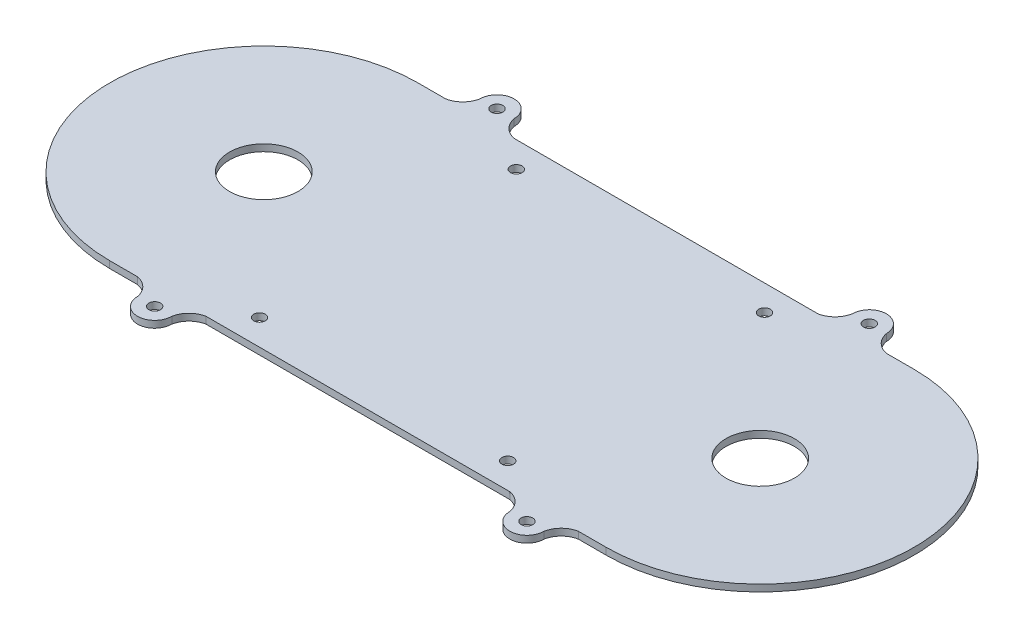
ISO-10303-21;
HEADER;
FILE_DESCRIPTION(('STEP AP214'),'2;1');
FILE_NAME('part.step','',(''),(''),'','','');
FILE_SCHEMA(('AUTOMOTIVE_DESIGN { 1 0 10303 214 1 1 1 1 }'));
ENDSEC;
DATA;
#1=APPLICATION_CONTEXT('core data for automotive mechanical design processes');
#2=APPLICATION_PROTOCOL_DEFINITION('international standard','automotive_design',2000,#1);
#3=PRODUCT_CONTEXT('',#1,'mechanical');
#4=PRODUCT('Part','Part','',(#3));
#5=PRODUCT_RELATED_PRODUCT_CATEGORY('part','',(#4));
#6=PRODUCT_DEFINITION_FORMATION('','',#4);
#7=PRODUCT_DEFINITION_CONTEXT('part definition',#1,'design');
#8=PRODUCT_DEFINITION('design','',#6,#7);
#9=PRODUCT_DEFINITION_SHAPE('','',#8);
#10=(LENGTH_UNIT() NAMED_UNIT(*) SI_UNIT(.MILLI.,.METRE.));
#11=(NAMED_UNIT(*) PLANE_ANGLE_UNIT() SI_UNIT($,.RADIAN.));
#12=(NAMED_UNIT(*) SI_UNIT($,.STERADIAN.) SOLID_ANGLE_UNIT());
#13=UNCERTAINTY_MEASURE_WITH_UNIT(LENGTH_MEASURE(1.E-05),#10,'distance_accuracy_value','');
#14=(GEOMETRIC_REPRESENTATION_CONTEXT(3) GLOBAL_UNCERTAINTY_ASSIGNED_CONTEXT((#13)) GLOBAL_UNIT_ASSIGNED_CONTEXT((#10,
#11,#12)) REPRESENTATION_CONTEXT('',''));
#15=CARTESIAN_POINT('',(0.,0.,0.));
#16=DIRECTION('',(0.,0.,1.));
#17=DIRECTION('',(1.,0.,0.));
#18=AXIS2_PLACEMENT_3D('',#15,#16,#17);
#19=CARTESIAN_POINT('',(0.,2.,0.));
#20=DIRECTION('',(0.,1.,0.));
#21=DIRECTION('',(0.,0.,1.));
#22=AXIS2_PLACEMENT_3D('',#19,#20,#21);
#23=PLANE('',#22);
#24=CARTESIAN_POINT('',(0.,2.,0.));
#25=DIRECTION('',(0.,1.,0.));
#26=DIRECTION('',(0.,0.,1.));
#27=AXIS2_PLACEMENT_3D('',#24,#25,#26);
#28=CIRCLE('',#27,10.);
#29=CARTESIAN_POINT('',(0.,2.,10.));
#30=VERTEX_POINT('',#29);
#31=EDGE_CURVE('E335',#30,#30,#28,.T.);
#32=ORIENTED_EDGE('',*,*,#31,.F.);
#33=EDGE_LOOP('',(#32));
#34=FACE_BOUND('',#33,.T.);
#35=CARTESIAN_POINT('',(145.,2.,0.));
#36=DIRECTION('',(0.,1.,0.));
#37=DIRECTION('',(0.,0.,1.));
#38=AXIS2_PLACEMENT_3D('',#35,#36,#37);
#39=CIRCLE('',#38,10.);
#40=CARTESIAN_POINT('',(145.,2.,10.));
#41=VERTEX_POINT('',#40);
#42=EDGE_CURVE('E496',#41,#41,#39,.T.);
#43=ORIENTED_EDGE('',*,*,#42,.F.);
#44=EDGE_LOOP('',(#43));
#45=FACE_BOUND('',#44,.T.);
#46=CARTESIAN_POINT('',(126.866817510313,2.,-49.9942003780549));
#47=DIRECTION('',(0.,1.,0.));
#48=DIRECTION('',(0.,0.,1.));
#49=AXIS2_PLACEMENT_3D('',#46,#47,#48);
#50=CIRCLE('',#49,1.70000000000001);
#51=CARTESIAN_POINT('',(126.866817510313,2.,-48.2942003780549));
#52=VERTEX_POINT('',#51);
#53=EDGE_CURVE('E341',#52,#52,#50,.F.);
#54=ORIENTED_EDGE('',*,*,#53,.T.);
#55=EDGE_LOOP('',(#54));
#56=FACE_BOUND('',#55,.T.);
#57=CARTESIAN_POINT('',(126.866817510313,2.,49.9942003780549));
#58=DIRECTION('',(0.,1.,0.));
#59=DIRECTION('',(0.,0.,1.));
#60=AXIS2_PLACEMENT_3D('',#57,#58,#59);
#61=CIRCLE('',#60,1.70000000000001);
#62=CARTESIAN_POINT('',(126.866817510313,2.,51.6942003780549));
#63=VERTEX_POINT('',#62);
#64=EDGE_CURVE('E346',#63,#63,#61,.T.);
#65=ORIENTED_EDGE('',*,*,#64,.F.);
#66=EDGE_LOOP('',(#65));
#67=FACE_BOUND('',#66,.T.);
#68=CARTESIAN_POINT('',(18.1168175103126,2.,49.9942003780549));
#69=DIRECTION('',(0.,1.,0.));
#70=DIRECTION('',(0.,0.,1.));
#71=AXIS2_PLACEMENT_3D('',#68,#69,#70);
#72=CIRCLE('',#71,1.7);
#73=CARTESIAN_POINT('',(18.1168175103126,2.,51.6942003780549));
#74=VERTEX_POINT('',#73);
#75=EDGE_CURVE('E324',#74,#74,#72,.T.);
#76=ORIENTED_EDGE('',*,*,#75,.F.);
#77=EDGE_LOOP('',(#76));
#78=FACE_BOUND('',#77,.T.);
#79=CARTESIAN_POINT('',(36.25,2.,-37.5000000000005));
#80=DIRECTION('',(0.,1.,0.));
#81=DIRECTION('',(0.,0.,1.));
#82=AXIS2_PLACEMENT_3D('',#79,#80,#81);
#83=CIRCLE('',#82,1.7);
#84=CARTESIAN_POINT('',(36.25,2.,-35.8000000000005));
#85=VERTEX_POINT('',#84);
#86=EDGE_CURVE('E281',#85,#85,#83,.F.);
#87=ORIENTED_EDGE('',*,*,#86,.T.);
#88=EDGE_LOOP('',(#87));
#89=FACE_BOUND('',#88,.T.);
#90=CARTESIAN_POINT('',(36.25,2.,37.5000000000005));
#91=DIRECTION('',(0.,1.,0.));
#92=DIRECTION('',(0.,0.,1.));
#93=AXIS2_PLACEMENT_3D('',#90,#91,#92);
#94=CIRCLE('',#93,1.7);
#95=CARTESIAN_POINT('',(36.25,2.,39.2000000000005));
#96=VERTEX_POINT('',#95);
#97=EDGE_CURVE('E354',#96,#96,#94,.T.);
#98=ORIENTED_EDGE('',*,*,#97,.F.);
#99=EDGE_LOOP('',(#98));
#100=FACE_BOUND('',#99,.T.);
#101=CARTESIAN_POINT('',(108.75,2.,37.5));
#102=DIRECTION('',(0.,1.,0.));
#103=DIRECTION('',(0.,0.,1.));
#104=AXIS2_PLACEMENT_3D('',#101,#102,#103);
#105=CIRCLE('',#104,1.7);
#106=CARTESIAN_POINT('',(108.75,2.,39.2));
#107=VERTEX_POINT('',#106);
#108=EDGE_CURVE('E357',#107,#107,#105,.T.);
#109=ORIENTED_EDGE('',*,*,#108,.F.);
#110=EDGE_LOOP('',(#109));
#111=FACE_BOUND('',#110,.T.);
#112=CARTESIAN_POINT('',(18.125,2.,-50.));
#113=DIRECTION('',(0.,1.,0.));
#114=DIRECTION('',(0.,0.,1.));
#115=AXIS2_PLACEMENT_3D('',#112,#113,#114);
#116=CIRCLE('',#115,5.);
#117=CARTESIAN_POINT('',(13.125,2.,-50.));
#118=VERTEX_POINT('',#117);
#119=CARTESIAN_POINT('',(23.125,2.,-50.));
#120=VERTEX_POINT('',#119);
#121=EDGE_CURVE('E360',#118,#120,#116,.F.);
#122=ORIENTED_EDGE('',*,*,#121,.F.);
#123=CARTESIAN_POINT('',(6.94058559663467,2.,-51.1844144033653));
#124=DIRECTION('',(0.,1.,0.));
#125=DIRECTION('',(0.,0.,1.));
#126=AXIS2_PLACEMENT_3D('',#123,#124,#125);
#127=CIRCLE('',#126,6.29681022355381);
#128=CARTESIAN_POINT('',(8.12499999999995,2.,-45.));
#129=VERTEX_POINT('',#128);
#130=EDGE_CURVE('E362',#118,#129,#127,.F.);
#131=ORIENTED_EDGE('',*,*,#130,.T.);
#132=DIRECTION('',(1.,0.,0.));
#133=VECTOR('',#132,1.);
#134=CARTESIAN_POINT('',(0.,2.,-45.));
#135=LINE('',#134,#133);
#136=CARTESIAN_POINT('',(0.,2.,-45.));
#137=VERTEX_POINT('',#136);
#138=EDGE_CURVE('E364',#137,#129,#135,.T.);
#139=ORIENTED_EDGE('',*,*,#138,.F.);
#140=CARTESIAN_POINT('',(0.,2.,0.));
#141=DIRECTION('',(0.,1.,0.));
#142=DIRECTION('',(0.,0.,1.));
#143=AXIS2_PLACEMENT_3D('',#140,#141,#142);
#144=CIRCLE('',#143,45.);
#145=CARTESIAN_POINT('',(0.,2.,45.));
#146=VERTEX_POINT('',#145);
#147=EDGE_CURVE('E367',#137,#146,#144,.T.);
#148=ORIENTED_EDGE('',*,*,#147,.T.);
#149=DIRECTION('',(1.,0.,0.));
#150=VECTOR('',#149,1.);
#151=CARTESIAN_POINT('',(0.,2.,45.));
#152=LINE('',#151,#150);
#153=CARTESIAN_POINT('',(8.12499999999995,2.,45.));
#154=VERTEX_POINT('',#153);
#155=EDGE_CURVE('E370',#146,#154,#152,.T.);
#156=ORIENTED_EDGE('',*,*,#155,.T.);
#157=CARTESIAN_POINT('',(6.94058559663467,2.,51.1844144033653));
#158=DIRECTION('',(0.,1.,0.));
#159=DIRECTION('',(0.,0.,1.));
#160=AXIS2_PLACEMENT_3D('',#157,#158,#159);
#161=CIRCLE('',#160,6.29681022355381);
#162=CARTESIAN_POINT('',(13.125,2.,50.));
#163=VERTEX_POINT('',#162);
#164=EDGE_CURVE('E372',#163,#154,#161,.T.);
#165=ORIENTED_EDGE('',*,*,#164,.F.);
#166=CARTESIAN_POINT('',(18.125,2.,50.));
#167=DIRECTION('',(0.,1.,0.));
#168=DIRECTION('',(0.,0.,1.));
#169=AXIS2_PLACEMENT_3D('',#166,#167,#168);
#170=CIRCLE('',#169,5.);
#171=CARTESIAN_POINT('',(23.125,2.,50.));
#172=VERTEX_POINT('',#171);
#173=EDGE_CURVE('E375',#163,#172,#170,.T.);
#174=ORIENTED_EDGE('',*,*,#173,.T.);
#175=CARTESIAN_POINT('',(29.3094144033653,2.,51.1844144033653));
#176=DIRECTION('',(0.,1.,0.));
#177=DIRECTION('',(0.,0.,1.));
#178=AXIS2_PLACEMENT_3D('',#175,#176,#177);
#179=CIRCLE('',#178,6.29681022355381);
#180=CARTESIAN_POINT('',(28.1250000000001,2.,45.));
#181=VERTEX_POINT('',#180);
#182=EDGE_CURVE('E378',#172,#181,#179,.F.);
#183=ORIENTED_EDGE('',*,*,#182,.T.);
#184=DIRECTION('',(1.,0.,0.));
#185=VECTOR('',#184,1.);
#186=CARTESIAN_POINT('',(0.,2.,45.));
#187=LINE('',#186,#185);
#188=CARTESIAN_POINT('',(116.875,2.,45.));
#189=VERTEX_POINT('',#188);
#190=EDGE_CURVE('E381',#181,#189,#187,.T.);
#191=ORIENTED_EDGE('',*,*,#190,.T.);
#192=CARTESIAN_POINT('',(115.690585596635,2.,51.1844144033653));
#193=DIRECTION('',(0.,1.,0.));
#194=DIRECTION('',(0.,0.,1.));
#195=AXIS2_PLACEMENT_3D('',#192,#193,#194);
#196=CIRCLE('',#195,6.29681022355381);
#197=CARTESIAN_POINT('',(121.875,2.,50.));
#198=VERTEX_POINT('',#197);
#199=EDGE_CURVE('E383',#198,#189,#196,.T.);
#200=ORIENTED_EDGE('',*,*,#199,.F.);
#201=CARTESIAN_POINT('',(126.875,2.,50.));
#202=DIRECTION('',(0.,1.,0.));
#203=DIRECTION('',(0.,0.,1.));
#204=AXIS2_PLACEMENT_3D('',#201,#202,#203);
#205=CIRCLE('',#204,5.);
#206=CARTESIAN_POINT('',(131.875,2.,50.));
#207=VERTEX_POINT('',#206);
#208=EDGE_CURVE('E386',#198,#207,#205,.T.);
#209=ORIENTED_EDGE('',*,*,#208,.T.);
#210=CARTESIAN_POINT('',(138.059414403365,2.,51.1844144033653));
#211=DIRECTION('',(0.,1.,0.));
#212=DIRECTION('',(0.,0.,1.));
#213=AXIS2_PLACEMENT_3D('',#210,#211,#212);
#214=CIRCLE('',#213,6.29681022355382);
#215=CARTESIAN_POINT('',(136.875,2.,45.));
#216=VERTEX_POINT('',#215);
#217=EDGE_CURVE('E389',#207,#216,#214,.F.);
#218=ORIENTED_EDGE('',*,*,#217,.T.);
#219=DIRECTION('',(-1.,0.,0.));
#220=VECTOR('',#219,1.);
#221=CARTESIAN_POINT('',(0.,2.,45.0000000000001));
#222=LINE('',#221,#220);
#223=CARTESIAN_POINT('',(145.,2.,45.));
#224=VERTEX_POINT('',#223);
#225=EDGE_CURVE('E391',#224,#216,#222,.T.);
#226=ORIENTED_EDGE('',*,*,#225,.F.);
#227=CARTESIAN_POINT('',(145.,2.,0.));
#228=DIRECTION('',(0.,1.,0.));
#229=DIRECTION('',(0.,0.,1.));
#230=AXIS2_PLACEMENT_3D('',#227,#228,#229);
#231=CIRCLE('',#230,45.);
#232=CARTESIAN_POINT('',(145.,2.,-45.));
#233=VERTEX_POINT('',#232);
#234=EDGE_CURVE('E394',#224,#233,#231,.T.);
#235=ORIENTED_EDGE('',*,*,#234,.T.);
#236=DIRECTION('',(1.,0.,0.));
#237=VECTOR('',#236,1.);
#238=CARTESIAN_POINT('',(0.,2.,-45.0000000000001));
#239=LINE('',#238,#237);
#240=CARTESIAN_POINT('',(136.875,2.,-45.));
#241=VERTEX_POINT('',#240);
#242=EDGE_CURVE('E396',#241,#233,#239,.T.);
#243=ORIENTED_EDGE('',*,*,#242,.F.);
#244=CARTESIAN_POINT('',(138.059414403365,2.,-51.1844144033653));
#245=DIRECTION('',(0.,1.,0.));
#246=DIRECTION('',(0.,0.,1.));
#247=AXIS2_PLACEMENT_3D('',#244,#245,#246);
#248=CIRCLE('',#247,6.29681022355382);
#249=CARTESIAN_POINT('',(131.875,2.,-50.));
#250=VERTEX_POINT('',#249);
#251=EDGE_CURVE('E399',#250,#241,#248,.T.);
#252=ORIENTED_EDGE('',*,*,#251,.F.);
#253=CARTESIAN_POINT('',(126.875,2.,-50.));
#254=DIRECTION('',(0.,1.,0.));
#255=DIRECTION('',(0.,0.,1.));
#256=AXIS2_PLACEMENT_3D('',#253,#254,#255);
#257=CIRCLE('',#256,5.);
#258=CARTESIAN_POINT('',(121.875,2.,-50.));
#259=VERTEX_POINT('',#258);
#260=EDGE_CURVE('E191',#259,#250,#257,.F.);
#261=ORIENTED_EDGE('',*,*,#260,.F.);
#262=CARTESIAN_POINT('',(115.690585596635,2.,-51.1844144033653));
#263=DIRECTION('',(0.,1.,0.));
#264=DIRECTION('',(0.,0.,1.));
#265=AXIS2_PLACEMENT_3D('',#262,#263,#264);
#266=CIRCLE('',#265,6.29681022355381);
#267=CARTESIAN_POINT('',(116.875,2.,-45.));
#268=VERTEX_POINT('',#267);
#269=EDGE_CURVE('E182',#259,#268,#266,.F.);
#270=ORIENTED_EDGE('',*,*,#269,.T.);
#271=DIRECTION('',(1.,0.,0.));
#272=VECTOR('',#271,1.);
#273=CARTESIAN_POINT('',(0.,2.,-45.));
#274=LINE('',#273,#272);
#275=CARTESIAN_POINT('',(28.1250000000001,2.,-45.));
#276=VERTEX_POINT('',#275);
#277=EDGE_CURVE('E188',#276,#268,#274,.T.);
#278=ORIENTED_EDGE('',*,*,#277,.F.);
#279=CARTESIAN_POINT('',(29.3094144033653,2.,-51.1844144033653));
#280=DIRECTION('',(0.,1.,0.));
#281=DIRECTION('',(0.,0.,1.));
#282=AXIS2_PLACEMENT_3D('',#279,#280,#281);
#283=CIRCLE('',#282,6.29681022355381);
#284=EDGE_CURVE('E204',#120,#276,#283,.T.);
#285=ORIENTED_EDGE('',*,*,#284,.F.);
#286=EDGE_LOOP('',(#122,#131,#139,#148,#156,#165,#174,#183,#191,#200,#209,#218,#226,#235,#243,
#252,#261,#270,#278,#285));
#287=FACE_BOUND('',#286,.T.);
#288=CARTESIAN_POINT('',(108.75,2.,-37.5));
#289=DIRECTION('',(0.,1.,0.));
#290=DIRECTION('',(0.,0.,1.));
#291=AXIS2_PLACEMENT_3D('',#288,#289,#290);
#292=CIRCLE('',#291,1.7);
#293=CARTESIAN_POINT('',(108.75,2.,-35.8));
#294=VERTEX_POINT('',#293);
#295=EDGE_CURVE('E206',#294,#294,#292,.F.);
#296=ORIENTED_EDGE('',*,*,#295,.T.);
#297=EDGE_LOOP('',(#296));
#298=FACE_BOUND('',#297,.T.);
#299=CARTESIAN_POINT('',(18.1168175103126,2.,-49.9942003780549));
#300=DIRECTION('',(0.,1.,0.));
#301=DIRECTION('',(0.,0.,1.));
#302=AXIS2_PLACEMENT_3D('',#299,#300,#301);
#303=CIRCLE('',#302,1.7);
#304=CARTESIAN_POINT('',(18.1168175103126,2.,-48.2942003780549));
#305=VERTEX_POINT('',#304);
#306=EDGE_CURVE('E337',#305,#305,#303,.F.);
#307=ORIENTED_EDGE('',*,*,#306,.T.);
#308=EDGE_LOOP('',(#307));
#309=FACE_BOUND('',#308,.T.);
#310=ADVANCED_FACE('F39',(#34,#45,#56,#67,#78,#89,#100,#111,#287,#298,#309),#23,.T.);
#311=CARTESIAN_POINT('',(0.,0.,0.));
#312=DIRECTION('',(0.,1.,0.));
#313=DIRECTION('',(0.,0.,1.));
#314=AXIS2_PLACEMENT_3D('',#311,#312,#313);
#315=PLANE('',#314);
#316=CARTESIAN_POINT('',(72.5,0.,0.));
#317=DIRECTION('',(0.,1.,0.));
#318=DIRECTION('',(0.,0.,1.));
#319=AXIS2_PLACEMENT_3D('',#316,#317,#318);
#320=CIRCLE('',#319,4.99999999999999);
#321=CARTESIAN_POINT('',(72.5,0.,5.));
#322=VERTEX_POINT('',#321);
#323=EDGE_CURVE('E11',#322,#322,#320,.F.);
#324=ORIENTED_EDGE('',*,*,#323,.F.);
#325=EDGE_LOOP('',(#324));
#326=FACE_BOUND('',#325,.T.);
#327=CARTESIAN_POINT('',(0.,0.,0.));
#328=DIRECTION('',(0.,1.,0.));
#329=DIRECTION('',(0.,0.,1.));
#330=AXIS2_PLACEMENT_3D('',#327,#328,#329);
#331=CIRCLE('',#330,10.);
#332=CARTESIAN_POINT('',(0.,0.,10.));
#333=VERTEX_POINT('',#332);
#334=EDGE_CURVE('E334',#333,#333,#331,.T.);
#335=ORIENTED_EDGE('',*,*,#334,.T.);
#336=EDGE_LOOP('',(#335));
#337=FACE_BOUND('',#336,.T.);
#338=CARTESIAN_POINT('',(145.,0.,0.));
#339=DIRECTION('',(0.,1.,0.));
#340=DIRECTION('',(0.,0.,1.));
#341=AXIS2_PLACEMENT_3D('',#338,#339,#340);
#342=CIRCLE('',#341,10.);
#343=CARTESIAN_POINT('',(145.,0.,10.));
#344=VERTEX_POINT('',#343);
#345=EDGE_CURVE('E332',#344,#344,#342,.T.);
#346=ORIENTED_EDGE('',*,*,#345,.T.);
#347=EDGE_LOOP('',(#346));
#348=FACE_BOUND('',#347,.T.);
#349=CARTESIAN_POINT('',(126.866817510313,0.,49.9942003780549));
#350=DIRECTION('',(0.,1.,0.));
#351=DIRECTION('',(0.,0.,1.));
#352=AXIS2_PLACEMENT_3D('',#349,#350,#351);
#353=CIRCLE('',#352,1.70000000000001);
#354=CARTESIAN_POINT('',(126.866817510313,0.,51.6942003780549));
#355=VERTEX_POINT('',#354);
#356=EDGE_CURVE('E323',#355,#355,#353,.T.);
#357=ORIENTED_EDGE('',*,*,#356,.T.);
#358=EDGE_LOOP('',(#357));
#359=FACE_BOUND('',#358,.T.);
#360=CARTESIAN_POINT('',(18.1168175103126,0.,49.9942003780549));
#361=DIRECTION('',(0.,1.,0.));
#362=DIRECTION('',(0.,0.,1.));
#363=AXIS2_PLACEMENT_3D('',#360,#361,#362);
#364=CIRCLE('',#363,1.7);
#365=CARTESIAN_POINT('',(18.1168175103126,0.,51.6942003780549));
#366=VERTEX_POINT('',#365);
#367=EDGE_CURVE('E320',#366,#366,#364,.T.);
#368=ORIENTED_EDGE('',*,*,#367,.T.);
#369=EDGE_LOOP('',(#368));
#370=FACE_BOUND('',#369,.T.);
#371=CARTESIAN_POINT('',(36.25,0.,-37.5000000000005));
#372=DIRECTION('',(0.,1.,0.));
#373=DIRECTION('',(0.,0.,1.));
#374=AXIS2_PLACEMENT_3D('',#371,#372,#373);
#375=CIRCLE('',#374,1.7);
#376=CARTESIAN_POINT('',(36.25,0.,-35.8000000000005));
#377=VERTEX_POINT('',#376);
#378=EDGE_CURVE('E212',#377,#377,#375,.F.);
#379=ORIENTED_EDGE('',*,*,#378,.F.);
#380=EDGE_LOOP('',(#379));
#381=FACE_BOUND('',#380,.T.);
#382=CARTESIAN_POINT('',(36.25,0.,37.5000000000005));
#383=DIRECTION('',(0.,1.,0.));
#384=DIRECTION('',(0.,0.,1.));
#385=AXIS2_PLACEMENT_3D('',#382,#383,#384);
#386=CIRCLE('',#385,1.7);
#387=CARTESIAN_POINT('',(36.25,0.,39.2000000000005));
#388=VERTEX_POINT('',#387);
#389=EDGE_CURVE('E215',#388,#388,#386,.T.);
#390=ORIENTED_EDGE('',*,*,#389,.T.);
#391=EDGE_LOOP('',(#390));
#392=FACE_BOUND('',#391,.T.);
#393=CARTESIAN_POINT('',(108.75,0.,37.5));
#394=DIRECTION('',(0.,1.,0.));
#395=DIRECTION('',(0.,0.,1.));
#396=AXIS2_PLACEMENT_3D('',#393,#394,#395);
#397=CIRCLE('',#396,1.7);
#398=CARTESIAN_POINT('',(108.75,0.,39.2));
#399=VERTEX_POINT('',#398);
#400=EDGE_CURVE('E219',#399,#399,#397,.T.);
#401=ORIENTED_EDGE('',*,*,#400,.T.);
#402=EDGE_LOOP('',(#401));
#403=FACE_BOUND('',#402,.T.);
#404=CARTESIAN_POINT('',(18.125,0.,-50.));
#405=DIRECTION('',(0.,1.,0.));
#406=DIRECTION('',(0.,0.,1.));
#407=AXIS2_PLACEMENT_3D('',#404,#405,#406);
#408=CIRCLE('',#407,5.);
#409=CARTESIAN_POINT('',(13.125,0.,-50.));
#410=VERTEX_POINT('',#409);
#411=CARTESIAN_POINT('',(23.125,0.,-50.));
#412=VERTEX_POINT('',#411);
#413=EDGE_CURVE('E222',#410,#412,#408,.F.);
#414=ORIENTED_EDGE('',*,*,#413,.T.);
#415=CARTESIAN_POINT('',(29.3094144033653,0.,-51.1844144033653));
#416=DIRECTION('',(0.,1.,0.));
#417=DIRECTION('',(0.,0.,1.));
#418=AXIS2_PLACEMENT_3D('',#415,#416,#417);
#419=CIRCLE('',#418,6.29681022355381);
#420=CARTESIAN_POINT('',(28.1250000000001,0.,-45.));
#421=VERTEX_POINT('',#420);
#422=EDGE_CURVE('E275',#412,#421,#419,.T.);
#423=ORIENTED_EDGE('',*,*,#422,.T.);
#424=DIRECTION('',(1.,0.,0.));
#425=VECTOR('',#424,1.);
#426=CARTESIAN_POINT('',(0.,0.,-45.));
#427=LINE('',#426,#425);
#428=CARTESIAN_POINT('',(116.875,0.,-45.));
#429=VERTEX_POINT('',#428);
#430=EDGE_CURVE('E273',#421,#429,#427,.T.);
#431=ORIENTED_EDGE('',*,*,#430,.T.);
#432=CARTESIAN_POINT('',(115.690585596635,0.,-51.1844144033653));
#433=DIRECTION('',(0.,1.,0.));
#434=DIRECTION('',(0.,0.,1.));
#435=AXIS2_PLACEMENT_3D('',#432,#433,#434);
#436=CIRCLE('',#435,6.29681022355381);
#437=CARTESIAN_POINT('',(121.875,0.,-50.));
#438=VERTEX_POINT('',#437);
#439=EDGE_CURVE('E198',#438,#429,#436,.F.);
#440=ORIENTED_EDGE('',*,*,#439,.F.);
#441=CARTESIAN_POINT('',(126.875,0.,-50.));
#442=DIRECTION('',(0.,1.,0.));
#443=DIRECTION('',(0.,0.,1.));
#444=AXIS2_PLACEMENT_3D('',#441,#442,#443);
#445=CIRCLE('',#444,5.);
#446=CARTESIAN_POINT('',(131.875,0.,-50.));
#447=VERTEX_POINT('',#446);
#448=EDGE_CURVE('E269',#438,#447,#445,.F.);
#449=ORIENTED_EDGE('',*,*,#448,.T.);
#450=CARTESIAN_POINT('',(138.059414403365,0.,-51.1844144033653));
#451=DIRECTION('',(0.,1.,0.));
#452=DIRECTION('',(0.,0.,1.));
#453=AXIS2_PLACEMENT_3D('',#450,#451,#452);
#454=CIRCLE('',#453,6.29681022355382);
#455=CARTESIAN_POINT('',(136.875,0.,-45.));
#456=VERTEX_POINT('',#455);
#457=EDGE_CURVE('E266',#447,#456,#454,.T.);
#458=ORIENTED_EDGE('',*,*,#457,.T.);
#459=DIRECTION('',(1.,0.,0.));
#460=VECTOR('',#459,1.);
#461=CARTESIAN_POINT('',(0.,0.,-45.0000000000001));
#462=LINE('',#461,#460);
#463=CARTESIAN_POINT('',(145.,0.,-45.));
#464=VERTEX_POINT('',#463);
#465=EDGE_CURVE('E263',#456,#464,#462,.T.);
#466=ORIENTED_EDGE('',*,*,#465,.T.);
#467=CARTESIAN_POINT('',(145.,0.,0.));
#468=DIRECTION('',(0.,1.,0.));
#469=DIRECTION('',(0.,0.,1.));
#470=AXIS2_PLACEMENT_3D('',#467,#468,#469);
#471=CIRCLE('',#470,45.);
#472=CARTESIAN_POINT('',(145.,0.,45.));
#473=VERTEX_POINT('',#472);
#474=EDGE_CURVE('E260',#473,#464,#471,.T.);
#475=ORIENTED_EDGE('',*,*,#474,.F.);
#476=DIRECTION('',(-1.,0.,0.));
#477=VECTOR('',#476,1.);
#478=CARTESIAN_POINT('',(0.,0.,45.0000000000001));
#479=LINE('',#478,#477);
#480=CARTESIAN_POINT('',(136.875,0.,45.));
#481=VERTEX_POINT('',#480);
#482=EDGE_CURVE('E257',#473,#481,#479,.T.);
#483=ORIENTED_EDGE('',*,*,#482,.T.);
#484=CARTESIAN_POINT('',(138.059414403365,0.,51.1844144033653));
#485=DIRECTION('',(0.,1.,0.));
#486=DIRECTION('',(0.,0.,1.));
#487=AXIS2_PLACEMENT_3D('',#484,#485,#486);
#488=CIRCLE('',#487,6.29681022355382);
#489=CARTESIAN_POINT('',(131.875,0.,50.));
#490=VERTEX_POINT('',#489);
#491=EDGE_CURVE('E254',#490,#481,#488,.F.);
#492=ORIENTED_EDGE('',*,*,#491,.F.);
#493=CARTESIAN_POINT('',(126.875,0.,50.));
#494=DIRECTION('',(0.,1.,0.));
#495=DIRECTION('',(0.,0.,1.));
#496=AXIS2_PLACEMENT_3D('',#493,#494,#495);
#497=CIRCLE('',#496,5.);
#498=CARTESIAN_POINT('',(121.875,0.,50.));
#499=VERTEX_POINT('',#498);
#500=EDGE_CURVE('E251',#499,#490,#497,.T.);
#501=ORIENTED_EDGE('',*,*,#500,.F.);
#502=CARTESIAN_POINT('',(115.690585596635,0.,51.1844144033653));
#503=DIRECTION('',(0.,1.,0.));
#504=DIRECTION('',(0.,0.,1.));
#505=AXIS2_PLACEMENT_3D('',#502,#503,#504);
#506=CIRCLE('',#505,6.29681022355381);
#507=CARTESIAN_POINT('',(116.875,0.,45.));
#508=VERTEX_POINT('',#507);
#509=EDGE_CURVE('E248',#499,#508,#506,.T.);
#510=ORIENTED_EDGE('',*,*,#509,.T.);
#511=DIRECTION('',(1.,0.,0.));
#512=VECTOR('',#511,1.);
#513=CARTESIAN_POINT('',(0.,0.,45.));
#514=LINE('',#513,#512);
#515=CARTESIAN_POINT('',(28.1250000000001,0.,45.));
#516=VERTEX_POINT('',#515);
#517=EDGE_CURVE('E245',#516,#508,#514,.T.);
#518=ORIENTED_EDGE('',*,*,#517,.F.);
#519=CARTESIAN_POINT('',(29.3094144033653,0.,51.1844144033653));
#520=DIRECTION('',(0.,1.,0.));
#521=DIRECTION('',(0.,0.,1.));
#522=AXIS2_PLACEMENT_3D('',#519,#520,#521);
#523=CIRCLE('',#522,6.29681022355381);
#524=CARTESIAN_POINT('',(23.125,0.,50.));
#525=VERTEX_POINT('',#524);
#526=EDGE_CURVE('E242',#525,#516,#523,.F.);
#527=ORIENTED_EDGE('',*,*,#526,.F.);
#528=CARTESIAN_POINT('',(18.125,0.,50.));
#529=DIRECTION('',(0.,1.,0.));
#530=DIRECTION('',(0.,0.,1.));
#531=AXIS2_PLACEMENT_3D('',#528,#529,#530);
#532=CIRCLE('',#531,5.);
#533=CARTESIAN_POINT('',(13.125,0.,50.));
#534=VERTEX_POINT('',#533);
#535=EDGE_CURVE('E239',#534,#525,#532,.T.);
#536=ORIENTED_EDGE('',*,*,#535,.F.);
#537=CARTESIAN_POINT('',(6.94058559663467,0.,51.1844144033653));
#538=DIRECTION('',(0.,1.,0.));
#539=DIRECTION('',(0.,0.,1.));
#540=AXIS2_PLACEMENT_3D('',#537,#538,#539);
#541=CIRCLE('',#540,6.29681022355381);
#542=CARTESIAN_POINT('',(8.12499999999995,0.,45.));
#543=VERTEX_POINT('',#542);
#544=EDGE_CURVE('E236',#534,#543,#541,.T.);
#545=ORIENTED_EDGE('',*,*,#544,.T.);
#546=DIRECTION('',(1.,0.,0.));
#547=VECTOR('',#546,1.);
#548=CARTESIAN_POINT('',(0.,0.,45.));
#549=LINE('',#548,#547);
#550=CARTESIAN_POINT('',(0.,0.,45.));
#551=VERTEX_POINT('',#550);
#552=EDGE_CURVE('E233',#551,#543,#549,.T.);
#553=ORIENTED_EDGE('',*,*,#552,.F.);
#554=CARTESIAN_POINT('',(0.,0.,0.));
#555=DIRECTION('',(0.,1.,0.));
#556=DIRECTION('',(0.,0.,1.));
#557=AXIS2_PLACEMENT_3D('',#554,#555,#556);
#558=CIRCLE('',#557,45.);
#559=CARTESIAN_POINT('',(0.,0.,-45.));
#560=VERTEX_POINT('',#559);
#561=EDGE_CURVE('E230',#560,#551,#558,.T.);
#562=ORIENTED_EDGE('',*,*,#561,.F.);
#563=DIRECTION('',(1.,0.,0.));
#564=VECTOR('',#563,1.);
#565=CARTESIAN_POINT('',(0.,0.,-45.));
#566=LINE('',#565,#564);
#567=CARTESIAN_POINT('',(8.12499999999995,0.,-45.));
#568=VERTEX_POINT('',#567);
#569=EDGE_CURVE('E227',#560,#568,#566,.T.);
#570=ORIENTED_EDGE('',*,*,#569,.T.);
#571=CARTESIAN_POINT('',(6.94058559663467,0.,-51.1844144033653));
#572=DIRECTION('',(0.,1.,0.));
#573=DIRECTION('',(0.,0.,1.));
#574=AXIS2_PLACEMENT_3D('',#571,#572,#573);
#575=CIRCLE('',#574,6.29681022355381);
#576=EDGE_CURVE('E224',#410,#568,#575,.F.);
#577=ORIENTED_EDGE('',*,*,#576,.F.);
#578=EDGE_LOOP('',(#414,#423,#431,#440,#449,#458,#466,#475,#483,#492,#501,#510,#518,#527,#536,
#545,#553,#562,#570,#577));
#579=FACE_BOUND('',#578,.T.);
#580=CARTESIAN_POINT('',(108.75,0.,-37.5));
#581=DIRECTION('',(0.,1.,0.));
#582=DIRECTION('',(0.,0.,1.));
#583=AXIS2_PLACEMENT_3D('',#580,#581,#582);
#584=CIRCLE('',#583,1.7);
#585=CARTESIAN_POINT('',(108.75,0.,-35.8));
#586=VERTEX_POINT('',#585);
#587=EDGE_CURVE('E278',#586,#586,#584,.F.);
#588=ORIENTED_EDGE('',*,*,#587,.F.);
#589=EDGE_LOOP('',(#588));
#590=FACE_BOUND('',#589,.T.);
#591=CARTESIAN_POINT('',(126.866817510313,0.,-49.9942003780549));
#592=DIRECTION('',(0.,1.,0.));
#593=DIRECTION('',(0.,0.,1.));
#594=AXIS2_PLACEMENT_3D('',#591,#592,#593);
#595=CIRCLE('',#594,1.70000000000001);
#596=CARTESIAN_POINT('',(126.866817510313,0.,-48.2942003780549));
#597=VERTEX_POINT('',#596);
#598=EDGE_CURVE('E327',#597,#597,#595,.F.);
#599=ORIENTED_EDGE('',*,*,#598,.F.);
#600=EDGE_LOOP('',(#599));
#601=FACE_BOUND('',#600,.T.);
#602=CARTESIAN_POINT('',(18.1168175103126,0.,-49.9942003780549));
#603=DIRECTION('',(0.,1.,0.));
#604=DIRECTION('',(0.,0.,1.));
#605=AXIS2_PLACEMENT_3D('',#602,#603,#604);
#606=CIRCLE('',#605,1.7);
#607=CARTESIAN_POINT('',(18.1168175103126,0.,-48.2942003780549));
#608=VERTEX_POINT('',#607);
#609=EDGE_CURVE('E216',#608,#608,#606,.F.);
#610=ORIENTED_EDGE('',*,*,#609,.F.);
#611=EDGE_LOOP('',(#610));
#612=FACE_BOUND('',#611,.T.);
#613=ADVANCED_FACE('F406',(#326,#337,#348,#359,#370,#381,#392,#403,#579,#590,#601,#612),#315,.F.);
#614=CARTESIAN_POINT('',(18.125,2.,-50.));
#615=DIRECTION('',(0.,-1.,0.));
#616=DIRECTION('',(0.,0.,-1.));
#617=AXIS2_PLACEMENT_3D('',#614,#615,#616);
#618=CYLINDRICAL_SURFACE('',#617,5.);
#619=ORIENTED_EDGE('',*,*,#413,.F.);
#620=DIRECTION('',(0.,-1.,0.));
#621=VECTOR('',#620,1.);
#622=CARTESIAN_POINT('',(13.125,2.,-50.));
#623=LINE('',#622,#621);
#624=EDGE_CURVE('E48',#118,#410,#623,.T.);
#625=ORIENTED_EDGE('',*,*,#624,.F.);
#626=ORIENTED_EDGE('',*,*,#121,.T.);
#627=DIRECTION('',(0.,-1.,0.));
#628=VECTOR('',#627,1.);
#629=CARTESIAN_POINT('',(23.125,2.,-50.));
#630=LINE('',#629,#628);
#631=EDGE_CURVE('E56',#120,#412,#630,.T.);
#632=ORIENTED_EDGE('',*,*,#631,.T.);
#633=EDGE_LOOP('',(#619,#625,#626,#632));
#634=FACE_BOUND('',#633,.T.);
#635=ADVANCED_FACE('F428',(#634),#618,.T.);
#636=CARTESIAN_POINT('',(6.94058559663467,2.,-51.1844144033653));
#637=DIRECTION('',(0.,-1.,0.));
#638=DIRECTION('',(0.,0.,-1.));
#639=AXIS2_PLACEMENT_3D('',#636,#637,#638);
#640=CYLINDRICAL_SURFACE('',#639,6.29681022355381);
#641=ORIENTED_EDGE('',*,*,#576,.T.);
#642=DIRECTION('',(0.,-1.,0.));
#643=VECTOR('',#642,1.);
#644=CARTESIAN_POINT('',(8.12499999999995,2.,-45.));
#645=LINE('',#644,#643);
#646=EDGE_CURVE('E317',#129,#568,#645,.T.);
#647=ORIENTED_EDGE('',*,*,#646,.F.);
#648=ORIENTED_EDGE('',*,*,#130,.F.);
#649=ORIENTED_EDGE('',*,*,#624,.T.);
#650=EDGE_LOOP('',(#641,#647,#648,#649));
#651=FACE_BOUND('',#650,.T.);
#652=ADVANCED_FACE('F527',(#651),#640,.F.);
#653=CARTESIAN_POINT('',(0.,2.,-45.));
#654=DIRECTION('',(0.,0.,-1.));
#655=DIRECTION('',(-1.,0.,0.));
#656=AXIS2_PLACEMENT_3D('',#653,#654,#655);
#657=PLANE('',#656);
#658=ORIENTED_EDGE('',*,*,#569,.F.);
#659=DIRECTION('',(0.,-1.,0.));
#660=VECTOR('',#659,1.);
#661=CARTESIAN_POINT('',(0.,2.,-45.));
#662=LINE('',#661,#660);
#663=EDGE_CURVE('E315',#137,#560,#662,.T.);
#664=ORIENTED_EDGE('',*,*,#663,.F.);
#665=ORIENTED_EDGE('',*,*,#138,.T.);
#666=ORIENTED_EDGE('',*,*,#646,.T.);
#667=EDGE_LOOP('',(#658,#664,#665,#666));
#668=FACE_BOUND('',#667,.T.);
#669=ADVANCED_FACE('F530',(#668),#657,.T.);
#670=CARTESIAN_POINT('',(0.,2.,0.));
#671=DIRECTION('',(0.,-1.,0.));
#672=DIRECTION('',(0.,0.,-1.));
#673=AXIS2_PLACEMENT_3D('',#670,#671,#672);
#674=CYLINDRICAL_SURFACE('',#673,45.);
#675=ORIENTED_EDGE('',*,*,#561,.T.);
#676=DIRECTION('',(0.,-1.,0.));
#677=VECTOR('',#676,1.);
#678=CARTESIAN_POINT('',(0.,2.,45.));
#679=LINE('',#678,#677);
#680=EDGE_CURVE('E312',#146,#551,#679,.T.);
#681=ORIENTED_EDGE('',*,*,#680,.F.);
#682=ORIENTED_EDGE('',*,*,#147,.F.);
#683=ORIENTED_EDGE('',*,*,#663,.T.);
#684=EDGE_LOOP('',(#675,#681,#682,#683));
#685=FACE_BOUND('',#684,.T.);
#686=ADVANCED_FACE('F534',(#685),#674,.T.);
#687=CARTESIAN_POINT('',(0.,2.,45.));
#688=DIRECTION('',(0.,0.,-1.));
#689=DIRECTION('',(-1.,0.,0.));
#690=AXIS2_PLACEMENT_3D('',#687,#688,#689);
#691=PLANE('',#690);
#692=ORIENTED_EDGE('',*,*,#552,.T.);
#693=DIRECTION('',(0.,-1.,0.));
#694=VECTOR('',#693,1.);
#695=CARTESIAN_POINT('',(8.12499999999995,2.,45.));
#696=LINE('',#695,#694);
#697=EDGE_CURVE('E310',#154,#543,#696,.T.);
#698=ORIENTED_EDGE('',*,*,#697,.F.);
#699=ORIENTED_EDGE('',*,*,#155,.F.);
#700=ORIENTED_EDGE('',*,*,#680,.T.);
#701=EDGE_LOOP('',(#692,#698,#699,#700));
#702=FACE_BOUND('',#701,.T.);
#703=ADVANCED_FACE('F538',(#702),#691,.F.);
#704=CARTESIAN_POINT('',(6.94058559663467,2.,51.1844144033653));
#705=DIRECTION('',(0.,-1.,0.));
#706=DIRECTION('',(0.,0.,-1.));
#707=AXIS2_PLACEMENT_3D('',#704,#705,#706);
#708=CYLINDRICAL_SURFACE('',#707,6.29681022355381);
#709=ORIENTED_EDGE('',*,*,#544,.F.);
#710=DIRECTION('',(0.,-1.,0.));
#711=VECTOR('',#710,1.);
#712=CARTESIAN_POINT('',(13.125,2.,50.));
#713=LINE('',#712,#711);
#714=EDGE_CURVE('E308',#163,#534,#713,.T.);
#715=ORIENTED_EDGE('',*,*,#714,.F.);
#716=ORIENTED_EDGE('',*,*,#164,.T.);
#717=ORIENTED_EDGE('',*,*,#697,.T.);
#718=EDGE_LOOP('',(#709,#715,#716,#717));
#719=FACE_BOUND('',#718,.T.);
#720=ADVANCED_FACE('F542',(#719),#708,.F.);
#721=CARTESIAN_POINT('',(18.125,2.,50.));
#722=DIRECTION('',(0.,-1.,0.));
#723=DIRECTION('',(0.,0.,-1.));
#724=AXIS2_PLACEMENT_3D('',#721,#722,#723);
#725=CYLINDRICAL_SURFACE('',#724,5.);
#726=ORIENTED_EDGE('',*,*,#535,.T.);
#727=DIRECTION('',(0.,-1.,0.));
#728=VECTOR('',#727,1.);
#729=CARTESIAN_POINT('',(23.125,2.,50.));
#730=LINE('',#729,#728);
#731=EDGE_CURVE('E305',#172,#525,#730,.T.);
#732=ORIENTED_EDGE('',*,*,#731,.F.);
#733=ORIENTED_EDGE('',*,*,#173,.F.);
#734=ORIENTED_EDGE('',*,*,#714,.T.);
#735=EDGE_LOOP('',(#726,#732,#733,#734));
#736=FACE_BOUND('',#735,.T.);
#737=ADVANCED_FACE('F546',(#736),#725,.T.);
#738=CARTESIAN_POINT('',(29.3094144033653,2.,51.1844144033653));
#739=DIRECTION('',(0.,-1.,0.));
#740=DIRECTION('',(0.,0.,-1.));
#741=AXIS2_PLACEMENT_3D('',#738,#739,#740);
#742=CYLINDRICAL_SURFACE('',#741,6.29681022355381);
#743=ORIENTED_EDGE('',*,*,#526,.T.);
#744=DIRECTION('',(0.,-1.,0.));
#745=VECTOR('',#744,1.);
#746=CARTESIAN_POINT('',(28.1250000000001,2.,45.));
#747=LINE('',#746,#745);
#748=EDGE_CURVE('E302',#181,#516,#747,.T.);
#749=ORIENTED_EDGE('',*,*,#748,.F.);
#750=ORIENTED_EDGE('',*,*,#182,.F.);
#751=ORIENTED_EDGE('',*,*,#731,.T.);
#752=EDGE_LOOP('',(#743,#749,#750,#751));
#753=FACE_BOUND('',#752,.T.);
#754=ADVANCED_FACE('F550',(#753),#742,.F.);
#755=CARTESIAN_POINT('',(0.,2.,45.));
#756=DIRECTION('',(0.,0.,-1.));
#757=DIRECTION('',(-1.,0.,0.));
#758=AXIS2_PLACEMENT_3D('',#755,#756,#757);
#759=PLANE('',#758);
#760=ORIENTED_EDGE('',*,*,#517,.T.);
#761=DIRECTION('',(0.,-1.,0.));
#762=VECTOR('',#761,1.);
#763=CARTESIAN_POINT('',(116.875,2.,45.));
#764=LINE('',#763,#762);
#765=EDGE_CURVE('E300',#189,#508,#764,.T.);
#766=ORIENTED_EDGE('',*,*,#765,.F.);
#767=ORIENTED_EDGE('',*,*,#190,.F.);
#768=ORIENTED_EDGE('',*,*,#748,.T.);
#769=EDGE_LOOP('',(#760,#766,#767,#768));
#770=FACE_BOUND('',#769,.T.);
#771=ADVANCED_FACE('F554',(#770),#759,.F.);
#772=CARTESIAN_POINT('',(115.690585596635,2.,51.1844144033653));
#773=DIRECTION('',(0.,-1.,0.));
#774=DIRECTION('',(0.,0.,-1.));
#775=AXIS2_PLACEMENT_3D('',#772,#773,#774);
#776=CYLINDRICAL_SURFACE('',#775,6.29681022355381);
#777=ORIENTED_EDGE('',*,*,#509,.F.);
#778=DIRECTION('',(0.,-1.,0.));
#779=VECTOR('',#778,1.);
#780=CARTESIAN_POINT('',(121.875,2.,50.));
#781=LINE('',#780,#779);
#782=EDGE_CURVE('E298',#198,#499,#781,.T.);
#783=ORIENTED_EDGE('',*,*,#782,.F.);
#784=ORIENTED_EDGE('',*,*,#199,.T.);
#785=ORIENTED_EDGE('',*,*,#765,.T.);
#786=EDGE_LOOP('',(#777,#783,#784,#785));
#787=FACE_BOUND('',#786,.T.);
#788=ADVANCED_FACE('F558',(#787),#776,.F.);
#789=CARTESIAN_POINT('',(126.875,2.,50.));
#790=DIRECTION('',(0.,-1.,0.));
#791=DIRECTION('',(0.,0.,-1.));
#792=AXIS2_PLACEMENT_3D('',#789,#790,#791);
#793=CYLINDRICAL_SURFACE('',#792,5.);
#794=ORIENTED_EDGE('',*,*,#500,.T.);
#795=DIRECTION('',(0.,-1.,0.));
#796=VECTOR('',#795,1.);
#797=CARTESIAN_POINT('',(131.875,2.,50.));
#798=LINE('',#797,#796);
#799=EDGE_CURVE('E295',#207,#490,#798,.T.);
#800=ORIENTED_EDGE('',*,*,#799,.F.);
#801=ORIENTED_EDGE('',*,*,#208,.F.);
#802=ORIENTED_EDGE('',*,*,#782,.T.);
#803=EDGE_LOOP('',(#794,#800,#801,#802));
#804=FACE_BOUND('',#803,.T.);
#805=ADVANCED_FACE('F562',(#804),#793,.T.);
#806=CARTESIAN_POINT('',(138.059414403365,2.,51.1844144033653));
#807=DIRECTION('',(0.,-1.,0.));
#808=DIRECTION('',(0.,0.,-1.));
#809=AXIS2_PLACEMENT_3D('',#806,#807,#808);
#810=CYLINDRICAL_SURFACE('',#809,6.29681022355382);
#811=ORIENTED_EDGE('',*,*,#491,.T.);
#812=DIRECTION('',(0.,-1.,0.));
#813=VECTOR('',#812,1.);
#814=CARTESIAN_POINT('',(136.875,2.,45.));
#815=LINE('',#814,#813);
#816=EDGE_CURVE('E293',#216,#481,#815,.T.);
#817=ORIENTED_EDGE('',*,*,#816,.F.);
#818=ORIENTED_EDGE('',*,*,#217,.F.);
#819=ORIENTED_EDGE('',*,*,#799,.T.);
#820=EDGE_LOOP('',(#811,#817,#818,#819));
#821=FACE_BOUND('',#820,.T.);
#822=ADVANCED_FACE('F566',(#821),#810,.F.);
#823=CARTESIAN_POINT('',(0.,2.,45.0000000000001));
#824=DIRECTION('',(0.,0.,1.));
#825=DIRECTION('',(1.,0.,0.));
#826=AXIS2_PLACEMENT_3D('',#823,#824,#825);
#827=PLANE('',#826);
#828=ORIENTED_EDGE('',*,*,#482,.F.);
#829=DIRECTION('',(0.,-1.,0.));
#830=VECTOR('',#829,1.);
#831=CARTESIAN_POINT('',(145.,2.,45.));
#832=LINE('',#831,#830);
#833=EDGE_CURVE('E291',#224,#473,#832,.T.);
#834=ORIENTED_EDGE('',*,*,#833,.F.);
#835=ORIENTED_EDGE('',*,*,#225,.T.);
#836=ORIENTED_EDGE('',*,*,#816,.T.);
#837=EDGE_LOOP('',(#828,#834,#835,#836));
#838=FACE_BOUND('',#837,.T.);
#839=ADVANCED_FACE('F570',(#838),#827,.T.);
#840=CARTESIAN_POINT('',(145.,2.,0.));
#841=DIRECTION('',(0.,-1.,0.));
#842=DIRECTION('',(0.,0.,-1.));
#843=AXIS2_PLACEMENT_3D('',#840,#841,#842);
#844=CYLINDRICAL_SURFACE('',#843,45.);
#845=ORIENTED_EDGE('',*,*,#474,.T.);
#846=DIRECTION('',(0.,-1.,0.));
#847=VECTOR('',#846,1.);
#848=CARTESIAN_POINT('',(145.,2.,-45.));
#849=LINE('',#848,#847);
#850=EDGE_CURVE('E289',#233,#464,#849,.T.);
#851=ORIENTED_EDGE('',*,*,#850,.F.);
#852=ORIENTED_EDGE('',*,*,#234,.F.);
#853=ORIENTED_EDGE('',*,*,#833,.T.);
#854=EDGE_LOOP('',(#845,#851,#852,#853));
#855=FACE_BOUND('',#854,.T.);
#856=ADVANCED_FACE('F574',(#855),#844,.T.);
#857=CARTESIAN_POINT('',(0.,2.,-45.0000000000001));
#858=DIRECTION('',(0.,0.,-1.));
#859=DIRECTION('',(-1.,0.,0.));
#860=AXIS2_PLACEMENT_3D('',#857,#858,#859);
#861=PLANE('',#860);
#862=ORIENTED_EDGE('',*,*,#465,.F.);
#863=DIRECTION('',(0.,-1.,0.));
#864=VECTOR('',#863,1.);
#865=CARTESIAN_POINT('',(136.875,2.,-45.));
#866=LINE('',#865,#864);
#867=EDGE_CURVE('E287',#241,#456,#866,.T.);
#868=ORIENTED_EDGE('',*,*,#867,.F.);
#869=ORIENTED_EDGE('',*,*,#242,.T.);
#870=ORIENTED_EDGE('',*,*,#850,.T.);
#871=EDGE_LOOP('',(#862,#868,#869,#870));
#872=FACE_BOUND('',#871,.T.);
#873=ADVANCED_FACE('F578',(#872),#861,.T.);
#874=CARTESIAN_POINT('',(138.059414403365,2.,-51.1844144033653));
#875=DIRECTION('',(0.,-1.,0.));
#876=DIRECTION('',(0.,0.,-1.));
#877=AXIS2_PLACEMENT_3D('',#874,#875,#876);
#878=CYLINDRICAL_SURFACE('',#877,6.29681022355382);
#879=ORIENTED_EDGE('',*,*,#457,.F.);
#880=DIRECTION('',(0.,-1.,0.));
#881=VECTOR('',#880,1.);
#882=CARTESIAN_POINT('',(131.875,2.,-50.));
#883=LINE('',#882,#881);
#884=EDGE_CURVE('E285',#250,#447,#883,.T.);
#885=ORIENTED_EDGE('',*,*,#884,.F.);
#886=ORIENTED_EDGE('',*,*,#251,.T.);
#887=ORIENTED_EDGE('',*,*,#867,.T.);
#888=EDGE_LOOP('',(#879,#885,#886,#887));
#889=FACE_BOUND('',#888,.T.);
#890=ADVANCED_FACE('F582',(#889),#878,.F.);
#891=CARTESIAN_POINT('',(126.875,2.,-50.));
#892=DIRECTION('',(0.,-1.,0.));
#893=DIRECTION('',(0.,0.,-1.));
#894=AXIS2_PLACEMENT_3D('',#891,#892,#893);
#895=CYLINDRICAL_SURFACE('',#894,5.);
#896=ORIENTED_EDGE('',*,*,#448,.F.);
#897=DIRECTION('',(0.,-1.,0.));
#898=VECTOR('',#897,1.);
#899=CARTESIAN_POINT('',(121.875,2.,-50.));
#900=LINE('',#899,#898);
#901=EDGE_CURVE('E201',#259,#438,#900,.T.);
#902=ORIENTED_EDGE('',*,*,#901,.F.);
#903=ORIENTED_EDGE('',*,*,#260,.T.);
#904=ORIENTED_EDGE('',*,*,#884,.T.);
#905=EDGE_LOOP('',(#896,#902,#903,#904));
#906=FACE_BOUND('',#905,.T.);
#907=ADVANCED_FACE('F403',(#906),#895,.T.);
#908=CARTESIAN_POINT('',(115.690585596635,2.,-51.1844144033653));
#909=DIRECTION('',(0.,-1.,0.));
#910=DIRECTION('',(0.,0.,-1.));
#911=AXIS2_PLACEMENT_3D('',#908,#909,#910);
#912=CYLINDRICAL_SURFACE('',#911,6.29681022355381);
#913=ORIENTED_EDGE('',*,*,#439,.T.);
#914=DIRECTION('',(0.,-1.,0.));
#915=VECTOR('',#914,1.);
#916=CARTESIAN_POINT('',(116.875,2.,-45.));
#917=LINE('',#916,#915);
#918=EDGE_CURVE('E195',#268,#429,#917,.T.);
#919=ORIENTED_EDGE('',*,*,#918,.F.);
#920=ORIENTED_EDGE('',*,*,#269,.F.);
#921=ORIENTED_EDGE('',*,*,#901,.T.);
#922=EDGE_LOOP('',(#913,#919,#920,#921));
#923=FACE_BOUND('',#922,.T.);
#924=ADVANCED_FACE('F196',(#923),#912,.F.);
#925=CARTESIAN_POINT('',(0.,2.,-45.));
#926=DIRECTION('',(0.,0.,-1.));
#927=DIRECTION('',(-1.,0.,0.));
#928=AXIS2_PLACEMENT_3D('',#925,#926,#927);
#929=PLANE('',#928);
#930=ORIENTED_EDGE('',*,*,#430,.F.);
#931=DIRECTION('',(0.,-1.,0.));
#932=VECTOR('',#931,1.);
#933=CARTESIAN_POINT('',(28.1250000000001,2.,-45.));
#934=LINE('',#933,#932);
#935=EDGE_CURVE('E119',#276,#421,#934,.T.);
#936=ORIENTED_EDGE('',*,*,#935,.F.);
#937=ORIENTED_EDGE('',*,*,#277,.T.);
#938=ORIENTED_EDGE('',*,*,#918,.T.);
#939=EDGE_LOOP('',(#930,#936,#937,#938));
#940=FACE_BOUND('',#939,.T.);
#941=ADVANCED_FACE('F203',(#940),#929,.T.);
#942=CARTESIAN_POINT('',(29.3094144033653,2.,-51.1844144033653));
#943=DIRECTION('',(0.,-1.,0.));
#944=DIRECTION('',(0.,0.,-1.));
#945=AXIS2_PLACEMENT_3D('',#942,#943,#944);
#946=CYLINDRICAL_SURFACE('',#945,6.29681022355381);
#947=ORIENTED_EDGE('',*,*,#422,.F.);
#948=ORIENTED_EDGE('',*,*,#631,.F.);
#949=ORIENTED_EDGE('',*,*,#284,.T.);
#950=ORIENTED_EDGE('',*,*,#935,.T.);
#951=EDGE_LOOP('',(#947,#948,#949,#950));
#952=FACE_BOUND('',#951,.T.);
#953=ADVANCED_FACE('F409',(#952),#946,.F.);
#954=CARTESIAN_POINT('',(108.75,2.,37.5));
#955=DIRECTION('',(0.,-1.,0.));
#956=DIRECTION('',(0.,0.,-1.));
#957=AXIS2_PLACEMENT_3D('',#954,#955,#956);
#958=CYLINDRICAL_SURFACE('',#957,1.7);
#959=ORIENTED_EDGE('',*,*,#108,.T.);
#960=EDGE_LOOP('',(#959));
#961=FACE_BOUND('',#960,.T.);
#962=ORIENTED_EDGE('',*,*,#400,.F.);
#963=EDGE_LOOP('',(#962));
#964=FACE_BOUND('',#963,.T.);
#965=ADVANCED_FACE('F411',(#961,#964),#958,.F.);
#966=CARTESIAN_POINT('',(36.25,2.,37.5000000000005));
#967=DIRECTION('',(0.,-1.,0.));
#968=DIRECTION('',(0.,0.,-1.));
#969=AXIS2_PLACEMENT_3D('',#966,#967,#968);
#970=CYLINDRICAL_SURFACE('',#969,1.7);
#971=ORIENTED_EDGE('',*,*,#97,.T.);
#972=EDGE_LOOP('',(#971));
#973=FACE_BOUND('',#972,.T.);
#974=ORIENTED_EDGE('',*,*,#389,.F.);
#975=EDGE_LOOP('',(#974));
#976=FACE_BOUND('',#975,.T.);
#977=ADVANCED_FACE('F417',(#973,#976),#970,.F.);
#978=CARTESIAN_POINT('',(36.25,2.,-37.5000000000005));
#979=DIRECTION('',(0.,-1.,0.));
#980=DIRECTION('',(0.,0.,-1.));
#981=AXIS2_PLACEMENT_3D('',#978,#979,#980);
#982=CYLINDRICAL_SURFACE('',#981,1.7);
#983=ORIENTED_EDGE('',*,*,#86,.F.);
#984=EDGE_LOOP('',(#983));
#985=FACE_BOUND('',#984,.T.);
#986=ORIENTED_EDGE('',*,*,#378,.T.);
#987=EDGE_LOOP('',(#986));
#988=FACE_BOUND('',#987,.T.);
#989=ADVANCED_FACE('F41',(#985,#988),#982,.F.);
#990=CARTESIAN_POINT('',(108.75,2.,-37.5));
#991=DIRECTION('',(0.,-1.,0.));
#992=DIRECTION('',(0.,0.,-1.));
#993=AXIS2_PLACEMENT_3D('',#990,#991,#992);
#994=CYLINDRICAL_SURFACE('',#993,1.7);
#995=ORIENTED_EDGE('',*,*,#295,.F.);
#996=EDGE_LOOP('',(#995));
#997=FACE_BOUND('',#996,.T.);
#998=ORIENTED_EDGE('',*,*,#587,.T.);
#999=EDGE_LOOP('',(#998));
#1000=FACE_BOUND('',#999,.T.);
#1001=ADVANCED_FACE('F436',(#997,#1000),#994,.F.);
#1002=CARTESIAN_POINT('',(18.1168175103126,-2.,49.9942003780549));
#1003=DIRECTION('',(0.,1.,0.));
#1004=DIRECTION('',(0.,0.,1.));
#1005=AXIS2_PLACEMENT_3D('',#1002,#1003,#1004);
#1006=CYLINDRICAL_SURFACE('',#1005,1.7);
#1007=ORIENTED_EDGE('',*,*,#75,.T.);
#1008=EDGE_LOOP('',(#1007));
#1009=FACE_BOUND('',#1008,.T.);
#1010=ORIENTED_EDGE('',*,*,#367,.F.);
#1011=EDGE_LOOP('',(#1010));
#1012=FACE_BOUND('',#1011,.T.);
#1013=ADVANCED_FACE('F434',(#1009,#1012),#1006,.F.);
#1014=CARTESIAN_POINT('',(126.866817510313,-2.,49.9942003780549));
#1015=DIRECTION('',(0.,1.,0.));
#1016=DIRECTION('',(0.,0.,1.));
#1017=AXIS2_PLACEMENT_3D('',#1014,#1015,#1016);
#1018=CYLINDRICAL_SURFACE('',#1017,1.70000000000001);
#1019=ORIENTED_EDGE('',*,*,#64,.T.);
#1020=EDGE_LOOP('',(#1019));
#1021=FACE_BOUND('',#1020,.T.);
#1022=ORIENTED_EDGE('',*,*,#356,.F.);
#1023=EDGE_LOOP('',(#1022));
#1024=FACE_BOUND('',#1023,.T.);
#1025=ADVANCED_FACE('F443',(#1021,#1024),#1018,.F.);
#1026=CARTESIAN_POINT('',(126.866817510313,-2.,-49.9942003780549));
#1027=DIRECTION('',(0.,1.,0.));
#1028=DIRECTION('',(0.,0.,1.));
#1029=AXIS2_PLACEMENT_3D('',#1026,#1027,#1028);
#1030=CYLINDRICAL_SURFACE('',#1029,1.70000000000001);
#1031=ORIENTED_EDGE('',*,*,#53,.F.);
#1032=EDGE_LOOP('',(#1031));
#1033=FACE_BOUND('',#1032,.T.);
#1034=ORIENTED_EDGE('',*,*,#598,.T.);
#1035=EDGE_LOOP('',(#1034));
#1036=FACE_BOUND('',#1035,.T.);
#1037=ADVANCED_FACE('F457',(#1033,#1036),#1030,.F.);
#1038=CARTESIAN_POINT('',(18.1168175103126,-2.,-49.9942003780549));
#1039=DIRECTION('',(0.,1.,0.));
#1040=DIRECTION('',(0.,0.,1.));
#1041=AXIS2_PLACEMENT_3D('',#1038,#1039,#1040);
#1042=CYLINDRICAL_SURFACE('',#1041,1.7);
#1043=ORIENTED_EDGE('',*,*,#306,.F.);
#1044=EDGE_LOOP('',(#1043));
#1045=FACE_BOUND('',#1044,.T.);
#1046=ORIENTED_EDGE('',*,*,#609,.T.);
#1047=EDGE_LOOP('',(#1046));
#1048=FACE_BOUND('',#1047,.T.);
#1049=ADVANCED_FACE('F454',(#1045,#1048),#1042,.F.);
#1050=CARTESIAN_POINT('',(145.,-8.,0.));
#1051=DIRECTION('',(0.,1.,0.));
#1052=DIRECTION('',(0.,0.,1.));
#1053=AXIS2_PLACEMENT_3D('',#1050,#1051,#1052);
#1054=CYLINDRICAL_SURFACE('',#1053,10.);
#1055=ORIENTED_EDGE('',*,*,#42,.T.);
#1056=EDGE_LOOP('',(#1055));
#1057=FACE_BOUND('',#1056,.T.);
#1058=ORIENTED_EDGE('',*,*,#345,.F.);
#1059=EDGE_LOOP('',(#1058));
#1060=FACE_BOUND('',#1059,.T.);
#1061=ADVANCED_FACE('F456',(#1057,#1060),#1054,.F.);
#1062=CARTESIAN_POINT('',(0.,-8.,0.));
#1063=DIRECTION('',(0.,1.,0.));
#1064=DIRECTION('',(0.,0.,1.));
#1065=AXIS2_PLACEMENT_3D('',#1062,#1063,#1064);
#1066=CYLINDRICAL_SURFACE('',#1065,10.);
#1067=ORIENTED_EDGE('',*,*,#31,.T.);
#1068=EDGE_LOOP('',(#1067));
#1069=FACE_BOUND('',#1068,.T.);
#1070=ORIENTED_EDGE('',*,*,#334,.F.);
#1071=EDGE_LOOP('',(#1070));
#1072=FACE_BOUND('',#1071,.T.);
#1073=ADVANCED_FACE('F463',(#1069,#1072),#1066,.F.);
#1074=CARTESIAN_POINT('',(72.5,-3.,0.));
#1075=DIRECTION('',(0.,1.,0.));
#1076=DIRECTION('',(0.,0.,1.));
#1077=AXIS2_PLACEMENT_3D('',#1074,#1075,#1076);
#1078=CYLINDRICAL_SURFACE('',#1077,4.99999999999999);
#1079=CARTESIAN_POINT('',(72.5,-3.,0.));
#1080=DIRECTION('',(0.,-1.,0.));
#1081=DIRECTION('',(0.,0.,-1.));
#1082=AXIS2_PLACEMENT_3D('',#1079,#1080,#1081);
#1083=CIRCLE('',#1082,4.99999999999999);
#1084=CARTESIAN_POINT('',(72.5,-3.,-4.99999999999998));
#1085=VERTEX_POINT('',#1084);
#1086=EDGE_CURVE('E493',#1085,#1085,#1083,.T.);
#1087=ORIENTED_EDGE('',*,*,#1086,.F.);
#1088=EDGE_LOOP('',(#1087));
#1089=FACE_BOUND('',#1088,.T.);
#1090=ORIENTED_EDGE('',*,*,#323,.T.);
#1091=EDGE_LOOP('',(#1090));
#1092=FACE_BOUND('',#1091,.T.);
#1093=ADVANCED_FACE('F474',(#1089,#1092),#1078,.T.);
#1094=CARTESIAN_POINT('',(72.5,-3.,0.));
#1095=DIRECTION('',(0.,-1.,0.));
#1096=DIRECTION('',(0.,0.,-1.));
#1097=AXIS2_PLACEMENT_3D('',#1094,#1095,#1096);
#1098=PLANE('',#1097);
#1099=CARTESIAN_POINT('',(72.5,-2.99999999999999,0.));
#1100=DIRECTION('',(0.,1.,0.));
#1101=DIRECTION('',(0.,0.,1.));
#1102=AXIS2_PLACEMENT_3D('',#1099,#1100,#1101);
#1103=CIRCLE('',#1102,3.00000000000001);
#1104=CARTESIAN_POINT('',(72.5,-2.99999999999998,3.00000000000002));
#1105=VERTEX_POINT('',#1104);
#1106=EDGE_CURVE('E492',#1105,#1105,#1103,.T.);
#1107=ORIENTED_EDGE('',*,*,#1106,.T.);
#1108=EDGE_LOOP('',(#1107));
#1109=FACE_BOUND('',#1108,.T.);
#1110=ORIENTED_EDGE('',*,*,#1086,.T.);
#1111=EDGE_LOOP('',(#1110));
#1112=FACE_BOUND('',#1111,.T.);
#1113=ADVANCED_FACE('F478',(#1109,#1112),#1098,.T.);
#1114=CARTESIAN_POINT('',(72.5,-2.99999999999999,0.));
#1115=DIRECTION('',(0.,-1.,0.));
#1116=DIRECTION('',(0.,0.,-1.));
#1117=AXIS2_PLACEMENT_3D('',#1114,#1115,#1116);
#1118=CONICAL_SURFACE('',#1117,3.00000000000001,0.785398163397451);
#1119=CARTESIAN_POINT('',(72.5,0.,0.));
#1120=VERTEX_POINT('',#1119);
#1121=VERTEX_LOOP('',#1120);
#1122=FACE_BOUND('',#1121,.T.);
#1123=ORIENTED_EDGE('',*,*,#1106,.F.);
#1124=EDGE_LOOP('',(#1123));
#1125=FACE_BOUND('',#1124,.T.);
#1126=ADVANCED_FACE('F482',(#1122,#1125),#1118,.F.);
#1127=CLOSED_SHELL('',(#310,#613,#635,#652,#669,#686,#703,#720,#737,#754,#771,#788,#805,#822,
#839,#856,#873,#890,#907,#924,#941,#953,#965,#977,#989,#1001,#1013,#1025,#1037,#1049,#1061,
#1073,#1093,#1113,#1126));
#1128=MANIFOLD_SOLID_BREP('B2',#1127);
#1129=ADVANCED_BREP_SHAPE_REPRESENTATION('',(#18,#1128),#14);
#1130=SHAPE_DEFINITION_REPRESENTATION(#9,#1129);
ENDSEC;
END-ISO-10303-21;
